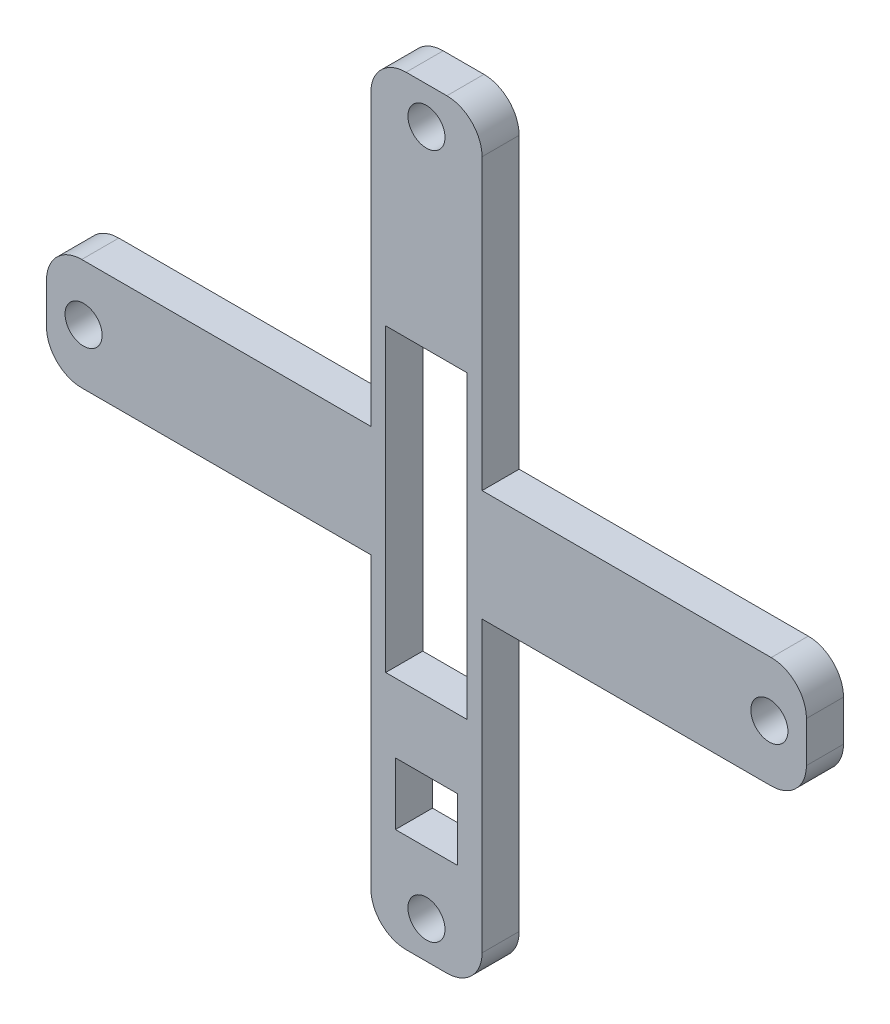
ISO-10303-21;
HEADER;
FILE_DESCRIPTION(('STEP AP214'),'2;1');
FILE_NAME('part.step','',(''),(''),'','','');
FILE_SCHEMA(('AUTOMOTIVE_DESIGN { 1 0 10303 214 1 1 1 1 }'));
ENDSEC;
DATA;
#1=APPLICATION_CONTEXT('core data for automotive mechanical design processes');
#2=APPLICATION_PROTOCOL_DEFINITION('international standard','automotive_design',2000,#1);
#3=PRODUCT_CONTEXT('',#1,'mechanical');
#4=PRODUCT('Part','Part','',(#3));
#5=PRODUCT_RELATED_PRODUCT_CATEGORY('part','',(#4));
#6=PRODUCT_DEFINITION_FORMATION('','',#4);
#7=PRODUCT_DEFINITION_CONTEXT('part definition',#1,'design');
#8=PRODUCT_DEFINITION('design','',#6,#7);
#9=PRODUCT_DEFINITION_SHAPE('','',#8);
#10=(LENGTH_UNIT() NAMED_UNIT(*) SI_UNIT(.MILLI.,.METRE.));
#11=(NAMED_UNIT(*) PLANE_ANGLE_UNIT() SI_UNIT($,.RADIAN.));
#12=(NAMED_UNIT(*) SI_UNIT($,.STERADIAN.) SOLID_ANGLE_UNIT());
#13=UNCERTAINTY_MEASURE_WITH_UNIT(LENGTH_MEASURE(1.E-05),#10,'distance_accuracy_value','');
#14=(GEOMETRIC_REPRESENTATION_CONTEXT(3) GLOBAL_UNCERTAINTY_ASSIGNED_CONTEXT((#13)) GLOBAL_UNIT_ASSIGNED_CONTEXT((#10,
#11,#12)) REPRESENTATION_CONTEXT('',''));
#15=CARTESIAN_POINT('',(0.,0.,0.));
#16=DIRECTION('',(0.,0.,1.));
#17=DIRECTION('',(1.,0.,0.));
#18=AXIS2_PLACEMENT_3D('',#15,#16,#17);
#19=CARTESIAN_POINT('',(-1.1,18.6,2.));
#20=DIRECTION('',(0.,0.,-1.));
#21=DIRECTION('',(-1.,0.,0.));
#22=AXIS2_PLACEMENT_3D('',#19,#20,#21);
#23=PLANE('',#22);
#24=CARTESIAN_POINT('',(-18.5,0.,2.));
#25=DIRECTION('',(0.,0.,1.));
#26=DIRECTION('',(1.,0.,0.));
#27=AXIS2_PLACEMENT_3D('',#24,#25,#26);
#28=CIRCLE('',#27,1.);
#29=CARTESIAN_POINT('',(-17.5,0.,2.));
#30=VERTEX_POINT('',#29);
#31=EDGE_CURVE('E254',#30,#30,#28,.T.);
#32=ORIENTED_EDGE('',*,*,#31,.F.);
#33=EDGE_LOOP('',(#32));
#34=FACE_BOUND('',#33,.T.);
#35=CARTESIAN_POINT('',(0.,-18.5,2.));
#36=DIRECTION('',(0.,0.,1.));
#37=DIRECTION('',(1.,0.,0.));
#38=AXIS2_PLACEMENT_3D('',#35,#36,#37);
#39=CIRCLE('',#38,1.);
#40=CARTESIAN_POINT('',(1.,-18.5,2.));
#41=VERTEX_POINT('',#40);
#42=EDGE_CURVE('E260',#41,#41,#39,.T.);
#43=ORIENTED_EDGE('',*,*,#42,.F.);
#44=EDGE_LOOP('',(#43));
#45=FACE_BOUND('',#44,.T.);
#46=CARTESIAN_POINT('',(18.5,0.,2.));
#47=DIRECTION('',(0.,0.,1.));
#48=DIRECTION('',(1.,0.,0.));
#49=AXIS2_PLACEMENT_3D('',#46,#47,#48);
#50=CIRCLE('',#49,1.);
#51=CARTESIAN_POINT('',(19.5,0.,2.));
#52=VERTEX_POINT('',#51);
#53=EDGE_CURVE('E266',#52,#52,#50,.T.);
#54=ORIENTED_EDGE('',*,*,#53,.F.);
#55=EDGE_LOOP('',(#54));
#56=FACE_BOUND('',#55,.T.);
#57=DIRECTION('',(0.,1.,0.));
#58=VECTOR('',#57,1.);
#59=CARTESIAN_POINT('',(1.675,-11.825,2.));
#60=LINE('',#59,#58);
#61=CARTESIAN_POINT('',(1.675,-15.175,2.));
#62=VERTEX_POINT('',#61);
#63=CARTESIAN_POINT('',(1.675,-11.825,2.));
#64=VERTEX_POINT('',#63);
#65=EDGE_CURVE('E272',#62,#64,#60,.T.);
#66=ORIENTED_EDGE('',*,*,#65,.F.);
#67=DIRECTION('',(1.,0.,0.));
#68=VECTOR('',#67,1.);
#69=CARTESIAN_POINT('',(-1.675,-15.175,2.));
#70=LINE('',#69,#68);
#71=CARTESIAN_POINT('',(-1.675,-15.175,2.));
#72=VERTEX_POINT('',#71);
#73=EDGE_CURVE('E280',#72,#62,#70,.T.);
#74=ORIENTED_EDGE('',*,*,#73,.F.);
#75=DIRECTION('',(0.,-1.,0.));
#76=VECTOR('',#75,1.);
#77=CARTESIAN_POINT('',(-1.675,-11.825,2.));
#78=LINE('',#77,#76);
#79=CARTESIAN_POINT('',(-1.675,-11.825,2.));
#80=VERTEX_POINT('',#79);
#81=EDGE_CURVE('E277',#80,#72,#78,.T.);
#82=ORIENTED_EDGE('',*,*,#81,.F.);
#83=DIRECTION('',(-1.,0.,0.));
#84=VECTOR('',#83,1.);
#85=CARTESIAN_POINT('',(-1.675,-11.825,2.));
#86=LINE('',#85,#84);
#87=EDGE_CURVE('E274',#64,#80,#86,.T.);
#88=ORIENTED_EDGE('',*,*,#87,.F.);
#89=EDGE_LOOP('',(#66,#74,#82,#88));
#90=FACE_BOUND('',#89,.T.);
#91=DIRECTION('',(-1.,0.,0.));
#92=VECTOR('',#91,1.);
#93=CARTESIAN_POINT('',(-18.6,3.,2.));
#94=LINE('',#93,#92);
#95=CARTESIAN_POINT('',(-3.,3.,2.));
#96=VERTEX_POINT('',#95);
#97=CARTESIAN_POINT('',(-18.6,3.,2.));
#98=VERTEX_POINT('',#97);
#99=EDGE_CURVE('E309',#96,#98,#94,.T.);
#100=ORIENTED_EDGE('',*,*,#99,.T.);
#101=CARTESIAN_POINT('',(-18.6,1.1,2.));
#102=DIRECTION('',(0.,0.,1.));
#103=DIRECTION('',(-1.,0.,0.));
#104=AXIS2_PLACEMENT_3D('',#101,#102,#103);
#105=CIRCLE('',#104,1.9);
#106=CARTESIAN_POINT('',(-20.5,1.1,2.));
#107=VERTEX_POINT('',#106);
#108=EDGE_CURVE('E312',#98,#107,#105,.T.);
#109=ORIENTED_EDGE('',*,*,#108,.T.);
#110=DIRECTION('',(0.,-1.,0.));
#111=VECTOR('',#110,1.);
#112=CARTESIAN_POINT('',(-20.5,-1.1,2.));
#113=LINE('',#112,#111);
#114=CARTESIAN_POINT('',(-20.5,-1.1,2.));
#115=VERTEX_POINT('',#114);
#116=EDGE_CURVE('E315',#107,#115,#113,.T.);
#117=ORIENTED_EDGE('',*,*,#116,.T.);
#118=CARTESIAN_POINT('',(-18.6,-1.1,2.));
#119=DIRECTION('',(0.,0.,1.));
#120=DIRECTION('',(-1.,0.,0.));
#121=AXIS2_PLACEMENT_3D('',#118,#119,#120);
#122=CIRCLE('',#121,1.9);
#123=CARTESIAN_POINT('',(-18.6,-3.,2.));
#124=VERTEX_POINT('',#123);
#125=EDGE_CURVE('E317',#115,#124,#122,.T.);
#126=ORIENTED_EDGE('',*,*,#125,.T.);
#127=DIRECTION('',(1.,0.,0.));
#128=VECTOR('',#127,1.);
#129=CARTESIAN_POINT('',(-3.,-3.,2.));
#130=LINE('',#129,#128);
#131=CARTESIAN_POINT('',(-3.,-3.,2.));
#132=VERTEX_POINT('',#131);
#133=EDGE_CURVE('E319',#124,#132,#130,.T.);
#134=ORIENTED_EDGE('',*,*,#133,.T.);
#135=DIRECTION('',(0.,-1.,0.));
#136=VECTOR('',#135,1.);
#137=CARTESIAN_POINT('',(-3.,-18.6,2.));
#138=LINE('',#137,#136);
#139=CARTESIAN_POINT('',(-3.,-18.6,2.));
#140=VERTEX_POINT('',#139);
#141=EDGE_CURVE('E321',#132,#140,#138,.T.);
#142=ORIENTED_EDGE('',*,*,#141,.T.);
#143=CARTESIAN_POINT('',(-1.1,-18.6,2.));
#144=DIRECTION('',(0.,0.,1.));
#145=DIRECTION('',(-1.,0.,0.));
#146=AXIS2_PLACEMENT_3D('',#143,#144,#145);
#147=CIRCLE('',#146,1.9);
#148=CARTESIAN_POINT('',(-1.1,-20.5,2.));
#149=VERTEX_POINT('',#148);
#150=EDGE_CURVE('E323',#140,#149,#147,.T.);
#151=ORIENTED_EDGE('',*,*,#150,.T.);
#152=DIRECTION('',(1.,0.,0.));
#153=VECTOR('',#152,1.);
#154=CARTESIAN_POINT('',(1.1,-20.5,2.));
#155=LINE('',#154,#153);
#156=CARTESIAN_POINT('',(1.1,-20.5,2.));
#157=VERTEX_POINT('',#156);
#158=EDGE_CURVE('E325',#149,#157,#155,.T.);
#159=ORIENTED_EDGE('',*,*,#158,.T.);
#160=CARTESIAN_POINT('',(1.1,-18.6,2.));
#161=DIRECTION('',(0.,0.,1.));
#162=DIRECTION('',(-1.,0.,0.));
#163=AXIS2_PLACEMENT_3D('',#160,#161,#162);
#164=CIRCLE('',#163,1.9);
#165=CARTESIAN_POINT('',(3.,-18.6,2.));
#166=VERTEX_POINT('',#165);
#167=EDGE_CURVE('E327',#157,#166,#164,.T.);
#168=ORIENTED_EDGE('',*,*,#167,.T.);
#169=DIRECTION('',(0.,1.,0.));
#170=VECTOR('',#169,1.);
#171=CARTESIAN_POINT('',(3.,-3.,2.));
#172=LINE('',#171,#170);
#173=CARTESIAN_POINT('',(3.,-3.,2.));
#174=VERTEX_POINT('',#173);
#175=EDGE_CURVE('E329',#166,#174,#172,.T.);
#176=ORIENTED_EDGE('',*,*,#175,.T.);
#177=DIRECTION('',(1.,0.,0.));
#178=VECTOR('',#177,1.);
#179=CARTESIAN_POINT('',(18.6,-3.,2.));
#180=LINE('',#179,#178);
#181=CARTESIAN_POINT('',(18.6,-3.,2.));
#182=VERTEX_POINT('',#181);
#183=EDGE_CURVE('E331',#174,#182,#180,.T.);
#184=ORIENTED_EDGE('',*,*,#183,.T.);
#185=CARTESIAN_POINT('',(18.6,-1.1,2.));
#186=DIRECTION('',(0.,0.,1.));
#187=DIRECTION('',(-1.,0.,0.));
#188=AXIS2_PLACEMENT_3D('',#185,#186,#187);
#189=CIRCLE('',#188,1.9);
#190=CARTESIAN_POINT('',(20.5,-1.1,2.));
#191=VERTEX_POINT('',#190);
#192=EDGE_CURVE('E333',#182,#191,#189,.T.);
#193=ORIENTED_EDGE('',*,*,#192,.T.);
#194=DIRECTION('',(0.,1.,0.));
#195=VECTOR('',#194,1.);
#196=CARTESIAN_POINT('',(20.5,1.1,2.));
#197=LINE('',#196,#195);
#198=CARTESIAN_POINT('',(20.5,1.1,2.));
#199=VERTEX_POINT('',#198);
#200=EDGE_CURVE('E335',#191,#199,#197,.T.);
#201=ORIENTED_EDGE('',*,*,#200,.T.);
#202=CARTESIAN_POINT('',(18.6,1.1,2.));
#203=DIRECTION('',(0.,0.,1.));
#204=DIRECTION('',(-1.,0.,0.));
#205=AXIS2_PLACEMENT_3D('',#202,#203,#204);
#206=CIRCLE('',#205,1.9);
#207=CARTESIAN_POINT('',(18.6,3.,2.));
#208=VERTEX_POINT('',#207);
#209=EDGE_CURVE('E337',#199,#208,#206,.T.);
#210=ORIENTED_EDGE('',*,*,#209,.T.);
#211=DIRECTION('',(-1.,0.,0.));
#212=VECTOR('',#211,1.);
#213=CARTESIAN_POINT('',(3.,3.,2.));
#214=LINE('',#213,#212);
#215=CARTESIAN_POINT('',(3.,3.,2.));
#216=VERTEX_POINT('',#215);
#217=EDGE_CURVE('E339',#208,#216,#214,.T.);
#218=ORIENTED_EDGE('',*,*,#217,.T.);
#219=DIRECTION('',(0.,1.,0.));
#220=VECTOR('',#219,1.);
#221=CARTESIAN_POINT('',(2.99999999999999,18.6,2.));
#222=LINE('',#221,#220);
#223=CARTESIAN_POINT('',(2.99999999999999,18.6,2.));
#224=VERTEX_POINT('',#223);
#225=EDGE_CURVE('E341',#216,#224,#222,.T.);
#226=ORIENTED_EDGE('',*,*,#225,.T.);
#227=CARTESIAN_POINT('',(1.09999999999999,18.6,2.));
#228=DIRECTION('',(0.,0.,1.));
#229=DIRECTION('',(-1.,0.,0.));
#230=AXIS2_PLACEMENT_3D('',#227,#228,#229);
#231=CIRCLE('',#230,1.9);
#232=CARTESIAN_POINT('',(1.09999999999999,20.5,2.));
#233=VERTEX_POINT('',#232);
#234=EDGE_CURVE('E343',#224,#233,#231,.T.);
#235=ORIENTED_EDGE('',*,*,#234,.T.);
#236=DIRECTION('',(-1.,0.,0.));
#237=VECTOR('',#236,1.);
#238=CARTESIAN_POINT('',(-1.1,20.5,2.));
#239=LINE('',#238,#237);
#240=CARTESIAN_POINT('',(-1.1,20.5,2.));
#241=VERTEX_POINT('',#240);
#242=EDGE_CURVE('E345',#233,#241,#239,.T.);
#243=ORIENTED_EDGE('',*,*,#242,.T.);
#244=CARTESIAN_POINT('',(-1.1,18.6,2.));
#245=DIRECTION('',(0.,0.,1.));
#246=DIRECTION('',(-1.,0.,0.));
#247=AXIS2_PLACEMENT_3D('',#244,#245,#246);
#248=CIRCLE('',#247,1.9);
#249=CARTESIAN_POINT('',(-3.,18.6,2.));
#250=VERTEX_POINT('',#249);
#251=EDGE_CURVE('E347',#241,#250,#248,.T.);
#252=ORIENTED_EDGE('',*,*,#251,.T.);
#253=DIRECTION('',(0.,-1.,0.));
#254=VECTOR('',#253,1.);
#255=CARTESIAN_POINT('',(-3.,3.,2.));
#256=LINE('',#255,#254);
#257=EDGE_CURVE('E349',#250,#96,#256,.T.);
#258=ORIENTED_EDGE('',*,*,#257,.T.);
#259=EDGE_LOOP('',(#100,#109,#117,#126,#134,#142,#151,#159,#168,#176,#184,#193,#201,#210,#218,
#226,#235,#243,#252,#258));
#260=FACE_BOUND('',#259,.T.);
#261=CARTESIAN_POINT('',(0.,18.5,2.));
#262=DIRECTION('',(0.,0.,1.));
#263=DIRECTION('',(1.,0.,0.));
#264=AXIS2_PLACEMENT_3D('',#261,#262,#263);
#265=CIRCLE('',#264,1.);
#266=CARTESIAN_POINT('',(0.999999999999995,18.5,2.));
#267=VERTEX_POINT('',#266);
#268=EDGE_CURVE('E303',#267,#267,#265,.T.);
#269=ORIENTED_EDGE('',*,*,#268,.F.);
#270=EDGE_LOOP('',(#269));
#271=FACE_BOUND('',#270,.T.);
#272=DIRECTION('',(0.,1.,0.));
#273=VECTOR('',#272,1.);
#274=CARTESIAN_POINT('',(2.2,-8.1,2.));
#275=LINE('',#274,#273);
#276=CARTESIAN_POINT('',(2.2,-8.1,2.));
#277=VERTEX_POINT('',#276);
#278=CARTESIAN_POINT('',(2.2,8.1,2.));
#279=VERTEX_POINT('',#278);
#280=EDGE_CURVE('E218',#277,#279,#275,.T.);
#281=ORIENTED_EDGE('',*,*,#280,.F.);
#282=DIRECTION('',(1.,0.,0.));
#283=VECTOR('',#282,1.);
#284=CARTESIAN_POINT('',(-2.2,-8.1,2.));
#285=LINE('',#284,#283);
#286=CARTESIAN_POINT('',(-2.2,-8.1,2.));
#287=VERTEX_POINT('',#286);
#288=EDGE_CURVE('E240',#287,#277,#285,.T.);
#289=ORIENTED_EDGE('',*,*,#288,.F.);
#290=DIRECTION('',(0.,-1.,0.));
#291=VECTOR('',#290,1.);
#292=CARTESIAN_POINT('',(-2.2,-8.1,2.));
#293=LINE('',#292,#291);
#294=CARTESIAN_POINT('',(-2.2,8.1,2.));
#295=VERTEX_POINT('',#294);
#296=EDGE_CURVE('E238',#295,#287,#293,.T.);
#297=ORIENTED_EDGE('',*,*,#296,.F.);
#298=DIRECTION('',(-1.,0.,0.));
#299=VECTOR('',#298,1.);
#300=CARTESIAN_POINT('',(-2.2,8.1,2.));
#301=LINE('',#300,#299);
#302=EDGE_CURVE('E226',#279,#295,#301,.T.);
#303=ORIENTED_EDGE('',*,*,#302,.F.);
#304=EDGE_LOOP('',(#281,#289,#297,#303));
#305=FACE_BOUND('',#304,.T.);
#306=ADVANCED_FACE('F33',(#34,#45,#56,#90,#260,#271,#305),#23,.F.);
#307=CARTESIAN_POINT('',(-1.1,18.6,0.));
#308=DIRECTION('',(0.,0.,-1.));
#309=DIRECTION('',(-1.,0.,0.));
#310=AXIS2_PLACEMENT_3D('',#307,#308,#309);
#311=PLANE('',#310);
#312=CARTESIAN_POINT('',(0.,-18.5,0.));
#313=DIRECTION('',(0.,0.,1.));
#314=DIRECTION('',(1.,0.,0.));
#315=AXIS2_PLACEMENT_3D('',#312,#313,#314);
#316=CIRCLE('',#315,1.);
#317=CARTESIAN_POINT('',(1.,-18.5,0.));
#318=VERTEX_POINT('',#317);
#319=EDGE_CURVE('E257',#318,#318,#316,.T.);
#320=ORIENTED_EDGE('',*,*,#319,.T.);
#321=EDGE_LOOP('',(#320));
#322=FACE_BOUND('',#321,.T.);
#323=DIRECTION('',(1.,0.,0.));
#324=VECTOR('',#323,1.);
#325=CARTESIAN_POINT('',(-1.675,-15.175,0.));
#326=LINE('',#325,#324);
#327=CARTESIAN_POINT('',(-1.675,-15.175,0.));
#328=VERTEX_POINT('',#327);
#329=CARTESIAN_POINT('',(1.675,-15.175,0.));
#330=VERTEX_POINT('',#329);
#331=EDGE_CURVE('E275',#328,#330,#326,.T.);
#332=ORIENTED_EDGE('',*,*,#331,.T.);
#333=DIRECTION('',(0.,1.,0.));
#334=VECTOR('',#333,1.);
#335=CARTESIAN_POINT('',(1.675,-11.825,0.));
#336=LINE('',#335,#334);
#337=CARTESIAN_POINT('',(1.675,-11.825,0.));
#338=VERTEX_POINT('',#337);
#339=EDGE_CURVE('E269',#330,#338,#336,.T.);
#340=ORIENTED_EDGE('',*,*,#339,.T.);
#341=DIRECTION('',(-1.,0.,0.));
#342=VECTOR('',#341,1.);
#343=CARTESIAN_POINT('',(-1.675,-11.825,0.));
#344=LINE('',#343,#342);
#345=CARTESIAN_POINT('',(-1.675,-11.825,0.));
#346=VERTEX_POINT('',#345);
#347=EDGE_CURVE('E285',#338,#346,#344,.T.);
#348=ORIENTED_EDGE('',*,*,#347,.T.);
#349=DIRECTION('',(0.,-1.,0.));
#350=VECTOR('',#349,1.);
#351=CARTESIAN_POINT('',(-1.675,-11.825,0.));
#352=LINE('',#351,#350);
#353=EDGE_CURVE('E288',#346,#328,#352,.T.);
#354=ORIENTED_EDGE('',*,*,#353,.T.);
#355=EDGE_LOOP('',(#332,#340,#348,#354));
#356=FACE_BOUND('',#355,.T.);
#357=CARTESIAN_POINT('',(0.,18.5,0.));
#358=DIRECTION('',(0.,0.,1.));
#359=DIRECTION('',(1.,0.,0.));
#360=AXIS2_PLACEMENT_3D('',#357,#358,#359);
#361=CIRCLE('',#360,1.);
#362=CARTESIAN_POINT('',(0.999999999999995,18.5,0.));
#363=VERTEX_POINT('',#362);
#364=EDGE_CURVE('E302',#363,#363,#361,.T.);
#365=ORIENTED_EDGE('',*,*,#364,.T.);
#366=EDGE_LOOP('',(#365));
#367=FACE_BOUND('',#366,.T.);
#368=DIRECTION('',(-1.,0.,0.));
#369=VECTOR('',#368,1.);
#370=CARTESIAN_POINT('',(-18.6,3.,0.));
#371=LINE('',#370,#369);
#372=CARTESIAN_POINT('',(-3.,3.,0.));
#373=VERTEX_POINT('',#372);
#374=CARTESIAN_POINT('',(-18.6,3.,0.));
#375=VERTEX_POINT('',#374);
#376=EDGE_CURVE('E306',#373,#375,#371,.T.);
#377=ORIENTED_EDGE('',*,*,#376,.F.);
#378=DIRECTION('',(0.,-1.,0.));
#379=VECTOR('',#378,1.);
#380=CARTESIAN_POINT('',(-3.,3.,0.));
#381=LINE('',#380,#379);
#382=CARTESIAN_POINT('',(-3.,18.6,0.));
#383=VERTEX_POINT('',#382);
#384=EDGE_CURVE('E313',#383,#373,#381,.T.);
#385=ORIENTED_EDGE('',*,*,#384,.F.);
#386=CARTESIAN_POINT('',(-1.1,18.6,0.));
#387=DIRECTION('',(0.,0.,1.));
#388=DIRECTION('',(-1.,0.,0.));
#389=AXIS2_PLACEMENT_3D('',#386,#387,#388);
#390=CIRCLE('',#389,1.9);
#391=CARTESIAN_POINT('',(-1.1,20.5,0.));
#392=VERTEX_POINT('',#391);
#393=EDGE_CURVE('E388',#392,#383,#390,.T.);
#394=ORIENTED_EDGE('',*,*,#393,.F.);
#395=DIRECTION('',(-1.,0.,0.));
#396=VECTOR('',#395,1.);
#397=CARTESIAN_POINT('',(-1.1,20.5,0.));
#398=LINE('',#397,#396);
#399=CARTESIAN_POINT('',(1.09999999999999,20.5,0.));
#400=VERTEX_POINT('',#399);
#401=EDGE_CURVE('E386',#400,#392,#398,.T.);
#402=ORIENTED_EDGE('',*,*,#401,.F.);
#403=CARTESIAN_POINT('',(1.09999999999999,18.6,0.));
#404=DIRECTION('',(0.,0.,1.));
#405=DIRECTION('',(-1.,0.,0.));
#406=AXIS2_PLACEMENT_3D('',#403,#404,#405);
#407=CIRCLE('',#406,1.9);
#408=CARTESIAN_POINT('',(2.99999999999999,18.6,0.));
#409=VERTEX_POINT('',#408);
#410=EDGE_CURVE('E384',#409,#400,#407,.T.);
#411=ORIENTED_EDGE('',*,*,#410,.F.);
#412=DIRECTION('',(0.,1.,0.));
#413=VECTOR('',#412,1.);
#414=CARTESIAN_POINT('',(2.99999999999999,18.6,0.));
#415=LINE('',#414,#413);
#416=CARTESIAN_POINT('',(3.,3.,0.));
#417=VERTEX_POINT('',#416);
#418=EDGE_CURVE('E382',#417,#409,#415,.T.);
#419=ORIENTED_EDGE('',*,*,#418,.F.);
#420=DIRECTION('',(-1.,0.,0.));
#421=VECTOR('',#420,1.);
#422=CARTESIAN_POINT('',(3.,3.,0.));
#423=LINE('',#422,#421);
#424=CARTESIAN_POINT('',(18.6,3.,0.));
#425=VERTEX_POINT('',#424);
#426=EDGE_CURVE('E380',#425,#417,#423,.T.);
#427=ORIENTED_EDGE('',*,*,#426,.F.);
#428=CARTESIAN_POINT('',(18.6,1.1,0.));
#429=DIRECTION('',(0.,0.,1.));
#430=DIRECTION('',(-1.,0.,0.));
#431=AXIS2_PLACEMENT_3D('',#428,#429,#430);
#432=CIRCLE('',#431,1.9);
#433=CARTESIAN_POINT('',(20.5,1.1,0.));
#434=VERTEX_POINT('',#433);
#435=EDGE_CURVE('E378',#434,#425,#432,.T.);
#436=ORIENTED_EDGE('',*,*,#435,.F.);
#437=DIRECTION('',(0.,1.,0.));
#438=VECTOR('',#437,1.);
#439=CARTESIAN_POINT('',(20.5,1.1,0.));
#440=LINE('',#439,#438);
#441=CARTESIAN_POINT('',(20.5,-1.1,0.));
#442=VERTEX_POINT('',#441);
#443=EDGE_CURVE('E376',#442,#434,#440,.T.);
#444=ORIENTED_EDGE('',*,*,#443,.F.);
#445=CARTESIAN_POINT('',(18.6,-1.1,0.));
#446=DIRECTION('',(0.,0.,1.));
#447=DIRECTION('',(-1.,0.,0.));
#448=AXIS2_PLACEMENT_3D('',#445,#446,#447);
#449=CIRCLE('',#448,1.9);
#450=CARTESIAN_POINT('',(18.6,-3.,0.));
#451=VERTEX_POINT('',#450);
#452=EDGE_CURVE('E374',#451,#442,#449,.T.);
#453=ORIENTED_EDGE('',*,*,#452,.F.);
#454=DIRECTION('',(1.,0.,0.));
#455=VECTOR('',#454,1.);
#456=CARTESIAN_POINT('',(18.6,-3.,0.));
#457=LINE('',#456,#455);
#458=CARTESIAN_POINT('',(3.,-3.,0.));
#459=VERTEX_POINT('',#458);
#460=EDGE_CURVE('E372',#459,#451,#457,.T.);
#461=ORIENTED_EDGE('',*,*,#460,.F.);
#462=DIRECTION('',(0.,1.,0.));
#463=VECTOR('',#462,1.);
#464=CARTESIAN_POINT('',(3.,-3.,0.));
#465=LINE('',#464,#463);
#466=CARTESIAN_POINT('',(3.,-18.6,0.));
#467=VERTEX_POINT('',#466);
#468=EDGE_CURVE('E370',#467,#459,#465,.T.);
#469=ORIENTED_EDGE('',*,*,#468,.F.);
#470=CARTESIAN_POINT('',(1.1,-18.6,0.));
#471=DIRECTION('',(0.,0.,1.));
#472=DIRECTION('',(-1.,0.,0.));
#473=AXIS2_PLACEMENT_3D('',#470,#471,#472);
#474=CIRCLE('',#473,1.9);
#475=CARTESIAN_POINT('',(1.1,-20.5,0.));
#476=VERTEX_POINT('',#475);
#477=EDGE_CURVE('E368',#476,#467,#474,.T.);
#478=ORIENTED_EDGE('',*,*,#477,.F.);
#479=DIRECTION('',(1.,0.,0.));
#480=VECTOR('',#479,1.);
#481=CARTESIAN_POINT('',(1.1,-20.5,0.));
#482=LINE('',#481,#480);
#483=CARTESIAN_POINT('',(-1.1,-20.5,0.));
#484=VERTEX_POINT('',#483);
#485=EDGE_CURVE('E366',#484,#476,#482,.T.);
#486=ORIENTED_EDGE('',*,*,#485,.F.);
#487=CARTESIAN_POINT('',(-1.1,-18.6,0.));
#488=DIRECTION('',(0.,0.,1.));
#489=DIRECTION('',(-1.,0.,0.));
#490=AXIS2_PLACEMENT_3D('',#487,#488,#489);
#491=CIRCLE('',#490,1.9);
#492=CARTESIAN_POINT('',(-3.,-18.6,0.));
#493=VERTEX_POINT('',#492);
#494=EDGE_CURVE('E364',#493,#484,#491,.T.);
#495=ORIENTED_EDGE('',*,*,#494,.F.);
#496=DIRECTION('',(0.,-1.,0.));
#497=VECTOR('',#496,1.);
#498=CARTESIAN_POINT('',(-3.,-18.6,0.));
#499=LINE('',#498,#497);
#500=CARTESIAN_POINT('',(-3.,-3.,0.));
#501=VERTEX_POINT('',#500);
#502=EDGE_CURVE('E362',#501,#493,#499,.T.);
#503=ORIENTED_EDGE('',*,*,#502,.F.);
#504=DIRECTION('',(1.,0.,0.));
#505=VECTOR('',#504,1.);
#506=CARTESIAN_POINT('',(-3.,-3.,0.));
#507=LINE('',#506,#505);
#508=CARTESIAN_POINT('',(-18.6,-3.,0.));
#509=VERTEX_POINT('',#508);
#510=EDGE_CURVE('E360',#509,#501,#507,.T.);
#511=ORIENTED_EDGE('',*,*,#510,.F.);
#512=CARTESIAN_POINT('',(-18.6,-1.1,0.));
#513=DIRECTION('',(0.,0.,1.));
#514=DIRECTION('',(-1.,0.,0.));
#515=AXIS2_PLACEMENT_3D('',#512,#513,#514);
#516=CIRCLE('',#515,1.9);
#517=CARTESIAN_POINT('',(-20.5,-1.1,0.));
#518=VERTEX_POINT('',#517);
#519=EDGE_CURVE('E358',#518,#509,#516,.T.);
#520=ORIENTED_EDGE('',*,*,#519,.F.);
#521=DIRECTION('',(0.,-1.,0.));
#522=VECTOR('',#521,1.);
#523=CARTESIAN_POINT('',(-20.5,-1.1,0.));
#524=LINE('',#523,#522);
#525=CARTESIAN_POINT('',(-20.5,1.1,0.));
#526=VERTEX_POINT('',#525);
#527=EDGE_CURVE('E356',#526,#518,#524,.T.);
#528=ORIENTED_EDGE('',*,*,#527,.F.);
#529=CARTESIAN_POINT('',(-18.6,1.1,0.));
#530=DIRECTION('',(0.,0.,1.));
#531=DIRECTION('',(-1.,0.,0.));
#532=AXIS2_PLACEMENT_3D('',#529,#530,#531);
#533=CIRCLE('',#532,1.9);
#534=EDGE_CURVE('E354',#375,#526,#533,.T.);
#535=ORIENTED_EDGE('',*,*,#534,.F.);
#536=EDGE_LOOP('',(#377,#385,#394,#402,#411,#419,#427,#436,#444,#453,#461,#469,#478,#486,#495,
#503,#511,#520,#528,#535));
#537=FACE_BOUND('',#536,.T.);
#538=CARTESIAN_POINT('',(18.5,0.,0.));
#539=DIRECTION('',(0.,0.,1.));
#540=DIRECTION('',(1.,0.,0.));
#541=AXIS2_PLACEMENT_3D('',#538,#539,#540);
#542=CIRCLE('',#541,1.);
#543=CARTESIAN_POINT('',(19.5,0.,0.));
#544=VERTEX_POINT('',#543);
#545=EDGE_CURVE('E263',#544,#544,#542,.T.);
#546=ORIENTED_EDGE('',*,*,#545,.T.);
#547=EDGE_LOOP('',(#546));
#548=FACE_BOUND('',#547,.T.);
#549=CARTESIAN_POINT('',(-18.5,0.,0.));
#550=DIRECTION('',(0.,0.,1.));
#551=DIRECTION('',(1.,0.,0.));
#552=AXIS2_PLACEMENT_3D('',#549,#550,#551);
#553=CIRCLE('',#552,1.);
#554=CARTESIAN_POINT('',(-17.5,0.,0.));
#555=VERTEX_POINT('',#554);
#556=EDGE_CURVE('E234',#555,#555,#553,.T.);
#557=ORIENTED_EDGE('',*,*,#556,.T.);
#558=EDGE_LOOP('',(#557));
#559=FACE_BOUND('',#558,.T.);
#560=DIRECTION('',(1.,0.,0.));
#561=VECTOR('',#560,1.);
#562=CARTESIAN_POINT('',(-2.2,-8.1,0.));
#563=LINE('',#562,#561);
#564=CARTESIAN_POINT('',(-2.2,-8.1,0.));
#565=VERTEX_POINT('',#564);
#566=CARTESIAN_POINT('',(2.2,-8.1,0.));
#567=VERTEX_POINT('',#566);
#568=EDGE_CURVE('E227',#565,#567,#563,.T.);
#569=ORIENTED_EDGE('',*,*,#568,.T.);
#570=DIRECTION('',(0.,1.,0.));
#571=VECTOR('',#570,1.);
#572=CARTESIAN_POINT('',(2.2,-8.1,0.));
#573=LINE('',#572,#571);
#574=CARTESIAN_POINT('',(2.2,8.1,0.));
#575=VERTEX_POINT('',#574);
#576=EDGE_CURVE('E56',#567,#575,#573,.T.);
#577=ORIENTED_EDGE('',*,*,#576,.T.);
#578=DIRECTION('',(-1.,0.,0.));
#579=VECTOR('',#578,1.);
#580=CARTESIAN_POINT('',(-2.2,8.1,0.));
#581=LINE('',#580,#579);
#582=CARTESIAN_POINT('',(-2.2,8.1,0.));
#583=VERTEX_POINT('',#582);
#584=EDGE_CURVE('E233',#575,#583,#581,.T.);
#585=ORIENTED_EDGE('',*,*,#584,.T.);
#586=DIRECTION('',(0.,-1.,0.));
#587=VECTOR('',#586,1.);
#588=CARTESIAN_POINT('',(-2.2,-8.1,0.));
#589=LINE('',#588,#587);
#590=EDGE_CURVE('E246',#583,#565,#589,.T.);
#591=ORIENTED_EDGE('',*,*,#590,.T.);
#592=EDGE_LOOP('',(#569,#577,#585,#591));
#593=FACE_BOUND('',#592,.T.);
#594=ADVANCED_FACE('F454',(#322,#356,#367,#537,#548,#559,#593),#311,.T.);
#595=CARTESIAN_POINT('',(-18.6,3.,2.));
#596=DIRECTION('',(0.,-1.,0.));
#597=DIRECTION('',(1.,0.,0.));
#598=AXIS2_PLACEMENT_3D('',#595,#596,#597);
#599=PLANE('',#598);
#600=ORIENTED_EDGE('',*,*,#376,.T.);
#601=DIRECTION('',(0.,0.,-1.));
#602=VECTOR('',#601,1.);
#603=CARTESIAN_POINT('',(-18.6,3.,2.));
#604=LINE('',#603,#602);
#605=EDGE_CURVE('E11',#98,#375,#604,.T.);
#606=ORIENTED_EDGE('',*,*,#605,.F.);
#607=ORIENTED_EDGE('',*,*,#99,.F.);
#608=DIRECTION('',(0.,0.,-1.));
#609=VECTOR('',#608,1.);
#610=CARTESIAN_POINT('',(-3.,3.,2.));
#611=LINE('',#610,#609);
#612=EDGE_CURVE('E351',#96,#373,#611,.T.);
#613=ORIENTED_EDGE('',*,*,#612,.T.);
#614=EDGE_LOOP('',(#600,#606,#607,#613));
#615=FACE_BOUND('',#614,.T.);
#616=ADVANCED_FACE('F35',(#615),#599,.F.);
#617=CARTESIAN_POINT('',(-18.6,1.1,2.));
#618=DIRECTION('',(0.,0.,-1.));
#619=DIRECTION('',(-1.,0.,0.));
#620=AXIS2_PLACEMENT_3D('',#617,#618,#619);
#621=CYLINDRICAL_SURFACE('',#620,1.9);
#622=ORIENTED_EDGE('',*,*,#534,.T.);
#623=DIRECTION('',(0.,0.,-1.));
#624=VECTOR('',#623,1.);
#625=CARTESIAN_POINT('',(-20.5,1.1,2.));
#626=LINE('',#625,#624);
#627=EDGE_CURVE('E41',#107,#526,#626,.T.);
#628=ORIENTED_EDGE('',*,*,#627,.F.);
#629=ORIENTED_EDGE('',*,*,#108,.F.);
#630=ORIENTED_EDGE('',*,*,#605,.T.);
#631=EDGE_LOOP('',(#622,#628,#629,#630));
#632=FACE_BOUND('',#631,.T.);
#633=ADVANCED_FACE('F472',(#632),#621,.T.);
#634=CARTESIAN_POINT('',(-20.5,-1.1,2.));
#635=DIRECTION('',(1.,0.,0.));
#636=DIRECTION('',(0.,1.,0.));
#637=AXIS2_PLACEMENT_3D('',#634,#635,#636);
#638=PLANE('',#637);
#639=ORIENTED_EDGE('',*,*,#527,.T.);
#640=DIRECTION('',(0.,0.,-1.));
#641=VECTOR('',#640,1.);
#642=CARTESIAN_POINT('',(-20.5,-1.1,2.));
#643=LINE('',#642,#641);
#644=EDGE_CURVE('E441',#115,#518,#643,.T.);
#645=ORIENTED_EDGE('',*,*,#644,.F.);
#646=ORIENTED_EDGE('',*,*,#116,.F.);
#647=ORIENTED_EDGE('',*,*,#627,.T.);
#648=EDGE_LOOP('',(#639,#645,#646,#647));
#649=FACE_BOUND('',#648,.T.);
#650=ADVANCED_FACE('F448',(#649),#638,.F.);
#651=CARTESIAN_POINT('',(-18.6,-1.1,2.));
#652=DIRECTION('',(0.,0.,-1.));
#653=DIRECTION('',(-1.,0.,0.));
#654=AXIS2_PLACEMENT_3D('',#651,#652,#653);
#655=CYLINDRICAL_SURFACE('',#654,1.9);
#656=ORIENTED_EDGE('',*,*,#519,.T.);
#657=DIRECTION('',(0.,0.,-1.));
#658=VECTOR('',#657,1.);
#659=CARTESIAN_POINT('',(-18.6,-3.,2.));
#660=LINE('',#659,#658);
#661=EDGE_CURVE('E438',#124,#509,#660,.T.);
#662=ORIENTED_EDGE('',*,*,#661,.F.);
#663=ORIENTED_EDGE('',*,*,#125,.F.);
#664=ORIENTED_EDGE('',*,*,#644,.T.);
#665=EDGE_LOOP('',(#656,#662,#663,#664));
#666=FACE_BOUND('',#665,.T.);
#667=ADVANCED_FACE('F460',(#666),#655,.T.);
#668=CARTESIAN_POINT('',(-3.,-3.,2.));
#669=DIRECTION('',(0.,1.,0.));
#670=DIRECTION('',(-1.,0.,0.));
#671=AXIS2_PLACEMENT_3D('',#668,#669,#670);
#672=PLANE('',#671);
#673=ORIENTED_EDGE('',*,*,#510,.T.);
#674=DIRECTION('',(0.,0.,-1.));
#675=VECTOR('',#674,1.);
#676=CARTESIAN_POINT('',(-3.,-3.,2.));
#677=LINE('',#676,#675);
#678=EDGE_CURVE('E435',#132,#501,#677,.T.);
#679=ORIENTED_EDGE('',*,*,#678,.F.);
#680=ORIENTED_EDGE('',*,*,#133,.F.);
#681=ORIENTED_EDGE('',*,*,#661,.T.);
#682=EDGE_LOOP('',(#673,#679,#680,#681));
#683=FACE_BOUND('',#682,.T.);
#684=ADVANCED_FACE('F464',(#683),#672,.F.);
#685=CARTESIAN_POINT('',(-3.,-18.6,2.));
#686=DIRECTION('',(1.,0.,0.));
#687=DIRECTION('',(0.,1.,0.));
#688=AXIS2_PLACEMENT_3D('',#685,#686,#687);
#689=PLANE('',#688);
#690=ORIENTED_EDGE('',*,*,#502,.T.);
#691=DIRECTION('',(0.,0.,-1.));
#692=VECTOR('',#691,1.);
#693=CARTESIAN_POINT('',(-3.,-18.6,2.));
#694=LINE('',#693,#692);
#695=EDGE_CURVE('E432',#140,#493,#694,.T.);
#696=ORIENTED_EDGE('',*,*,#695,.F.);
#697=ORIENTED_EDGE('',*,*,#141,.F.);
#698=ORIENTED_EDGE('',*,*,#678,.T.);
#699=EDGE_LOOP('',(#690,#696,#697,#698));
#700=FACE_BOUND('',#699,.T.);
#701=ADVANCED_FACE('F545',(#700),#689,.F.);
#702=CARTESIAN_POINT('',(-1.1,-18.6,2.));
#703=DIRECTION('',(0.,0.,-1.));
#704=DIRECTION('',(-1.,0.,0.));
#705=AXIS2_PLACEMENT_3D('',#702,#703,#704);
#706=CYLINDRICAL_SURFACE('',#705,1.9);
#707=ORIENTED_EDGE('',*,*,#494,.T.);
#708=DIRECTION('',(0.,0.,-1.));
#709=VECTOR('',#708,1.);
#710=CARTESIAN_POINT('',(-1.1,-20.5,2.));
#711=LINE('',#710,#709);
#712=EDGE_CURVE('E429',#149,#484,#711,.T.);
#713=ORIENTED_EDGE('',*,*,#712,.F.);
#714=ORIENTED_EDGE('',*,*,#150,.F.);
#715=ORIENTED_EDGE('',*,*,#695,.T.);
#716=EDGE_LOOP('',(#707,#713,#714,#715));
#717=FACE_BOUND('',#716,.T.);
#718=ADVANCED_FACE('F543',(#717),#706,.T.);
#719=CARTESIAN_POINT('',(1.1,-20.5,2.));
#720=DIRECTION('',(0.,1.,0.));
#721=DIRECTION('',(-1.,0.,0.));
#722=AXIS2_PLACEMENT_3D('',#719,#720,#721);
#723=PLANE('',#722);
#724=ORIENTED_EDGE('',*,*,#485,.T.);
#725=DIRECTION('',(0.,0.,-1.));
#726=VECTOR('',#725,1.);
#727=CARTESIAN_POINT('',(1.1,-20.5,2.));
#728=LINE('',#727,#726);
#729=EDGE_CURVE('E426',#157,#476,#728,.T.);
#730=ORIENTED_EDGE('',*,*,#729,.F.);
#731=ORIENTED_EDGE('',*,*,#158,.F.);
#732=ORIENTED_EDGE('',*,*,#712,.T.);
#733=EDGE_LOOP('',(#724,#730,#731,#732));
#734=FACE_BOUND('',#733,.T.);
#735=ADVANCED_FACE('F538',(#734),#723,.F.);
#736=CARTESIAN_POINT('',(1.1,-18.6,2.));
#737=DIRECTION('',(0.,0.,-1.));
#738=DIRECTION('',(-1.,0.,0.));
#739=AXIS2_PLACEMENT_3D('',#736,#737,#738);
#740=CYLINDRICAL_SURFACE('',#739,1.9);
#741=ORIENTED_EDGE('',*,*,#477,.T.);
#742=DIRECTION('',(0.,0.,-1.));
#743=VECTOR('',#742,1.);
#744=CARTESIAN_POINT('',(3.,-18.6,2.));
#745=LINE('',#744,#743);
#746=EDGE_CURVE('E423',#166,#467,#745,.T.);
#747=ORIENTED_EDGE('',*,*,#746,.F.);
#748=ORIENTED_EDGE('',*,*,#167,.F.);
#749=ORIENTED_EDGE('',*,*,#729,.T.);
#750=EDGE_LOOP('',(#741,#747,#748,#749));
#751=FACE_BOUND('',#750,.T.);
#752=ADVANCED_FACE('F533',(#751),#740,.T.);
#753=CARTESIAN_POINT('',(3.,-3.,2.));
#754=DIRECTION('',(-1.,0.,0.));
#755=DIRECTION('',(0.,-1.,0.));
#756=AXIS2_PLACEMENT_3D('',#753,#754,#755);
#757=PLANE('',#756);
#758=ORIENTED_EDGE('',*,*,#468,.T.);
#759=DIRECTION('',(0.,0.,-1.));
#760=VECTOR('',#759,1.);
#761=CARTESIAN_POINT('',(3.,-3.,2.));
#762=LINE('',#761,#760);
#763=EDGE_CURVE('E420',#174,#459,#762,.T.);
#764=ORIENTED_EDGE('',*,*,#763,.F.);
#765=ORIENTED_EDGE('',*,*,#175,.F.);
#766=ORIENTED_EDGE('',*,*,#746,.T.);
#767=EDGE_LOOP('',(#758,#764,#765,#766));
#768=FACE_BOUND('',#767,.T.);
#769=ADVANCED_FACE('F529',(#768),#757,.F.);
#770=CARTESIAN_POINT('',(18.6,-3.,2.));
#771=DIRECTION('',(0.,1.,0.));
#772=DIRECTION('',(-1.,0.,0.));
#773=AXIS2_PLACEMENT_3D('',#770,#771,#772);
#774=PLANE('',#773);
#775=ORIENTED_EDGE('',*,*,#460,.T.);
#776=DIRECTION('',(0.,0.,-1.));
#777=VECTOR('',#776,1.);
#778=CARTESIAN_POINT('',(18.6,-3.,2.));
#779=LINE('',#778,#777);
#780=EDGE_CURVE('E417',#182,#451,#779,.T.);
#781=ORIENTED_EDGE('',*,*,#780,.F.);
#782=ORIENTED_EDGE('',*,*,#183,.F.);
#783=ORIENTED_EDGE('',*,*,#763,.T.);
#784=EDGE_LOOP('',(#775,#781,#782,#783));
#785=FACE_BOUND('',#784,.T.);
#786=ADVANCED_FACE('F524',(#785),#774,.F.);
#787=CARTESIAN_POINT('',(18.6,-1.1,2.));
#788=DIRECTION('',(0.,0.,-1.));
#789=DIRECTION('',(-1.,0.,0.));
#790=AXIS2_PLACEMENT_3D('',#787,#788,#789);
#791=CYLINDRICAL_SURFACE('',#790,1.9);
#792=ORIENTED_EDGE('',*,*,#452,.T.);
#793=DIRECTION('',(0.,0.,-1.));
#794=VECTOR('',#793,1.);
#795=CARTESIAN_POINT('',(20.5,-1.1,2.));
#796=LINE('',#795,#794);
#797=EDGE_CURVE('E414',#191,#442,#796,.T.);
#798=ORIENTED_EDGE('',*,*,#797,.F.);
#799=ORIENTED_EDGE('',*,*,#192,.F.);
#800=ORIENTED_EDGE('',*,*,#780,.T.);
#801=EDGE_LOOP('',(#792,#798,#799,#800));
#802=FACE_BOUND('',#801,.T.);
#803=ADVANCED_FACE('F518',(#802),#791,.T.);
#804=CARTESIAN_POINT('',(20.5,1.1,2.));
#805=DIRECTION('',(-1.,0.,0.));
#806=DIRECTION('',(0.,0.,1.));
#807=AXIS2_PLACEMENT_3D('',#804,#805,#806);
#808=PLANE('',#807);
#809=ORIENTED_EDGE('',*,*,#443,.T.);
#810=DIRECTION('',(0.,0.,-1.));
#811=VECTOR('',#810,1.);
#812=CARTESIAN_POINT('',(20.5,1.1,2.));
#813=LINE('',#812,#811);
#814=EDGE_CURVE('E411',#199,#434,#813,.T.);
#815=ORIENTED_EDGE('',*,*,#814,.F.);
#816=ORIENTED_EDGE('',*,*,#200,.F.);
#817=ORIENTED_EDGE('',*,*,#797,.T.);
#818=EDGE_LOOP('',(#809,#815,#816,#817));
#819=FACE_BOUND('',#818,.T.);
#820=ADVANCED_FACE('F514',(#819),#808,.F.);
#821=CARTESIAN_POINT('',(18.6,1.1,2.));
#822=DIRECTION('',(0.,0.,-1.));
#823=DIRECTION('',(-1.,0.,0.));
#824=AXIS2_PLACEMENT_3D('',#821,#822,#823);
#825=CYLINDRICAL_SURFACE('',#824,1.9);
#826=ORIENTED_EDGE('',*,*,#435,.T.);
#827=DIRECTION('',(0.,0.,-1.));
#828=VECTOR('',#827,1.);
#829=CARTESIAN_POINT('',(18.6,3.,2.));
#830=LINE('',#829,#828);
#831=EDGE_CURVE('E408',#208,#425,#830,.T.);
#832=ORIENTED_EDGE('',*,*,#831,.F.);
#833=ORIENTED_EDGE('',*,*,#209,.F.);
#834=ORIENTED_EDGE('',*,*,#814,.T.);
#835=EDGE_LOOP('',(#826,#832,#833,#834));
#836=FACE_BOUND('',#835,.T.);
#837=ADVANCED_FACE('F509',(#836),#825,.T.);
#838=CARTESIAN_POINT('',(3.,3.,2.));
#839=DIRECTION('',(0.,-1.,0.));
#840=DIRECTION('',(1.,0.,0.));
#841=AXIS2_PLACEMENT_3D('',#838,#839,#840);
#842=PLANE('',#841);
#843=ORIENTED_EDGE('',*,*,#426,.T.);
#844=DIRECTION('',(0.,0.,-1.));
#845=VECTOR('',#844,1.);
#846=CARTESIAN_POINT('',(3.,3.,2.));
#847=LINE('',#846,#845);
#848=EDGE_CURVE('E405',#216,#417,#847,.T.);
#849=ORIENTED_EDGE('',*,*,#848,.F.);
#850=ORIENTED_EDGE('',*,*,#217,.F.);
#851=ORIENTED_EDGE('',*,*,#831,.T.);
#852=EDGE_LOOP('',(#843,#849,#850,#851));
#853=FACE_BOUND('',#852,.T.);
#854=ADVANCED_FACE('F503',(#853),#842,.F.);
#855=CARTESIAN_POINT('',(2.99999999999999,18.6,2.));
#856=DIRECTION('',(-1.,0.,0.));
#857=DIRECTION('',(0.,-1.,0.));
#858=AXIS2_PLACEMENT_3D('',#855,#856,#857);
#859=PLANE('',#858);
#860=ORIENTED_EDGE('',*,*,#418,.T.);
#861=DIRECTION('',(0.,0.,-1.));
#862=VECTOR('',#861,1.);
#863=CARTESIAN_POINT('',(2.99999999999999,18.6,2.));
#864=LINE('',#863,#862);
#865=EDGE_CURVE('E402',#224,#409,#864,.T.);
#866=ORIENTED_EDGE('',*,*,#865,.F.);
#867=ORIENTED_EDGE('',*,*,#225,.F.);
#868=ORIENTED_EDGE('',*,*,#848,.T.);
#869=EDGE_LOOP('',(#860,#866,#867,#868));
#870=FACE_BOUND('',#869,.T.);
#871=ADVANCED_FACE('F499',(#870),#859,.F.);
#872=CARTESIAN_POINT('',(1.09999999999999,18.6,2.));
#873=DIRECTION('',(0.,0.,-1.));
#874=DIRECTION('',(-1.,0.,0.));
#875=AXIS2_PLACEMENT_3D('',#872,#873,#874);
#876=CYLINDRICAL_SURFACE('',#875,1.9);
#877=ORIENTED_EDGE('',*,*,#410,.T.);
#878=DIRECTION('',(0.,0.,-1.));
#879=VECTOR('',#878,1.);
#880=CARTESIAN_POINT('',(1.09999999999999,20.5,2.));
#881=LINE('',#880,#879);
#882=EDGE_CURVE('E399',#233,#400,#881,.T.);
#883=ORIENTED_EDGE('',*,*,#882,.F.);
#884=ORIENTED_EDGE('',*,*,#234,.F.);
#885=ORIENTED_EDGE('',*,*,#865,.T.);
#886=EDGE_LOOP('',(#877,#883,#884,#885));
#887=FACE_BOUND('',#886,.T.);
#888=ADVANCED_FACE('F494',(#887),#876,.T.);
#889=CARTESIAN_POINT('',(-1.1,20.5,2.));
#890=DIRECTION('',(0.,-1.,0.));
#891=DIRECTION('',(0.,0.,-1.));
#892=AXIS2_PLACEMENT_3D('',#889,#890,#891);
#893=PLANE('',#892);
#894=ORIENTED_EDGE('',*,*,#401,.T.);
#895=DIRECTION('',(0.,0.,-1.));
#896=VECTOR('',#895,1.);
#897=CARTESIAN_POINT('',(-1.1,20.5,2.));
#898=LINE('',#897,#896);
#899=EDGE_CURVE('E396',#241,#392,#898,.T.);
#900=ORIENTED_EDGE('',*,*,#899,.F.);
#901=ORIENTED_EDGE('',*,*,#242,.F.);
#902=ORIENTED_EDGE('',*,*,#882,.T.);
#903=EDGE_LOOP('',(#894,#900,#901,#902));
#904=FACE_BOUND('',#903,.T.);
#905=ADVANCED_FACE('F488',(#904),#893,.F.);
#906=CARTESIAN_POINT('',(-1.1,18.6,2.));
#907=DIRECTION('',(0.,0.,-1.));
#908=DIRECTION('',(-1.,0.,0.));
#909=AXIS2_PLACEMENT_3D('',#906,#907,#908);
#910=CYLINDRICAL_SURFACE('',#909,1.9);
#911=ORIENTED_EDGE('',*,*,#393,.T.);
#912=DIRECTION('',(0.,0.,-1.));
#913=VECTOR('',#912,1.);
#914=CARTESIAN_POINT('',(-3.,18.6,2.));
#915=LINE('',#914,#913);
#916=EDGE_CURVE('E393',#250,#383,#915,.T.);
#917=ORIENTED_EDGE('',*,*,#916,.F.);
#918=ORIENTED_EDGE('',*,*,#251,.F.);
#919=ORIENTED_EDGE('',*,*,#899,.T.);
#920=EDGE_LOOP('',(#911,#917,#918,#919));
#921=FACE_BOUND('',#920,.T.);
#922=ADVANCED_FACE('F484',(#921),#910,.T.);
#923=CARTESIAN_POINT('',(-3.,3.,2.));
#924=DIRECTION('',(1.,0.,0.));
#925=DIRECTION('',(0.,1.,0.));
#926=AXIS2_PLACEMENT_3D('',#923,#924,#925);
#927=PLANE('',#926);
#928=ORIENTED_EDGE('',*,*,#384,.T.);
#929=ORIENTED_EDGE('',*,*,#612,.F.);
#930=ORIENTED_EDGE('',*,*,#257,.F.);
#931=ORIENTED_EDGE('',*,*,#916,.T.);
#932=EDGE_LOOP('',(#928,#929,#930,#931));
#933=FACE_BOUND('',#932,.T.);
#934=ADVANCED_FACE('F479',(#933),#927,.F.);
#935=CARTESIAN_POINT('',(0.,18.5,2.));
#936=DIRECTION('',(0.,0.,-1.));
#937=DIRECTION('',(-1.,0.,0.));
#938=AXIS2_PLACEMENT_3D('',#935,#936,#937);
#939=CYLINDRICAL_SURFACE('',#938,1.);
#940=ORIENTED_EDGE('',*,*,#268,.T.);
#941=EDGE_LOOP('',(#940));
#942=FACE_BOUND('',#941,.T.);
#943=ORIENTED_EDGE('',*,*,#364,.F.);
#944=EDGE_LOOP('',(#943));
#945=FACE_BOUND('',#944,.T.);
#946=ADVANCED_FACE('F565',(#942,#945),#939,.F.);
#947=CARTESIAN_POINT('',(1.675,-11.825,2.));
#948=DIRECTION('',(-1.,0.,0.));
#949=DIRECTION('',(0.,-1.,0.));
#950=AXIS2_PLACEMENT_3D('',#947,#948,#949);
#951=PLANE('',#950);
#952=ORIENTED_EDGE('',*,*,#339,.F.);
#953=DIRECTION('',(0.,0.,-1.));
#954=VECTOR('',#953,1.);
#955=CARTESIAN_POINT('',(1.675,-15.175,2.));
#956=LINE('',#955,#954);
#957=EDGE_CURVE('E282',#62,#330,#956,.T.);
#958=ORIENTED_EDGE('',*,*,#957,.F.);
#959=ORIENTED_EDGE('',*,*,#65,.T.);
#960=DIRECTION('',(0.,0.,-1.));
#961=VECTOR('',#960,1.);
#962=CARTESIAN_POINT('',(1.675,-11.825,2.));
#963=LINE('',#962,#961);
#964=EDGE_CURVE('E299',#64,#338,#963,.T.);
#965=ORIENTED_EDGE('',*,*,#964,.T.);
#966=EDGE_LOOP('',(#952,#958,#959,#965));
#967=FACE_BOUND('',#966,.T.);
#968=ADVANCED_FACE('F651',(#967),#951,.T.);
#969=CARTESIAN_POINT('',(-1.675,-11.825,2.));
#970=DIRECTION('',(0.,-1.,0.));
#971=DIRECTION('',(0.,0.,-1.));
#972=AXIS2_PLACEMENT_3D('',#969,#970,#971);
#973=PLANE('',#972);
#974=ORIENTED_EDGE('',*,*,#347,.F.);
#975=ORIENTED_EDGE('',*,*,#964,.F.);
#976=ORIENTED_EDGE('',*,*,#87,.T.);
#977=DIRECTION('',(0.,0.,-1.));
#978=VECTOR('',#977,1.);
#979=CARTESIAN_POINT('',(-1.675,-11.825,2.));
#980=LINE('',#979,#978);
#981=EDGE_CURVE('E297',#80,#346,#980,.T.);
#982=ORIENTED_EDGE('',*,*,#981,.T.);
#983=EDGE_LOOP('',(#974,#975,#976,#982));
#984=FACE_BOUND('',#983,.T.);
#985=ADVANCED_FACE('F658',(#984),#973,.T.);
#986=CARTESIAN_POINT('',(-1.675,-11.825,2.));
#987=DIRECTION('',(1.,0.,0.));
#988=DIRECTION('',(0.,0.,-1.));
#989=AXIS2_PLACEMENT_3D('',#986,#987,#988);
#990=PLANE('',#989);
#991=ORIENTED_EDGE('',*,*,#353,.F.);
#992=ORIENTED_EDGE('',*,*,#981,.F.);
#993=ORIENTED_EDGE('',*,*,#81,.T.);
#994=DIRECTION('',(0.,0.,-1.));
#995=VECTOR('',#994,1.);
#996=CARTESIAN_POINT('',(-1.675,-15.175,2.));
#997=LINE('',#996,#995);
#998=EDGE_CURVE('E295',#72,#328,#997,.T.);
#999=ORIENTED_EDGE('',*,*,#998,.T.);
#1000=EDGE_LOOP('',(#991,#992,#993,#999));
#1001=FACE_BOUND('',#1000,.T.);
#1002=ADVANCED_FACE('F665',(#1001),#990,.T.);
#1003=CARTESIAN_POINT('',(-1.675,-15.175,2.));
#1004=DIRECTION('',(0.,1.,0.));
#1005=DIRECTION('',(0.,0.,1.));
#1006=AXIS2_PLACEMENT_3D('',#1003,#1004,#1005);
#1007=PLANE('',#1006);
#1008=ORIENTED_EDGE('',*,*,#331,.F.);
#1009=ORIENTED_EDGE('',*,*,#998,.F.);
#1010=ORIENTED_EDGE('',*,*,#73,.T.);
#1011=ORIENTED_EDGE('',*,*,#957,.T.);
#1012=EDGE_LOOP('',(#1008,#1009,#1010,#1011));
#1013=FACE_BOUND('',#1012,.T.);
#1014=ADVANCED_FACE('F673',(#1013),#1007,.T.);
#1015=CARTESIAN_POINT('',(18.5,0.,2.));
#1016=DIRECTION('',(0.,0.,-1.));
#1017=DIRECTION('',(-1.,0.,0.));
#1018=AXIS2_PLACEMENT_3D('',#1015,#1016,#1017);
#1019=CYLINDRICAL_SURFACE('',#1018,1.);
#1020=ORIENTED_EDGE('',*,*,#53,.T.);
#1021=EDGE_LOOP('',(#1020));
#1022=FACE_BOUND('',#1021,.T.);
#1023=ORIENTED_EDGE('',*,*,#545,.F.);
#1024=EDGE_LOOP('',(#1023));
#1025=FACE_BOUND('',#1024,.T.);
#1026=ADVANCED_FACE('F681',(#1022,#1025),#1019,.F.);
#1027=CARTESIAN_POINT('',(0.,-18.5,2.));
#1028=DIRECTION('',(0.,0.,-1.));
#1029=DIRECTION('',(-1.,0.,0.));
#1030=AXIS2_PLACEMENT_3D('',#1027,#1028,#1029);
#1031=CYLINDRICAL_SURFACE('',#1030,1.);
#1032=ORIENTED_EDGE('',*,*,#42,.T.);
#1033=EDGE_LOOP('',(#1032));
#1034=FACE_BOUND('',#1033,.T.);
#1035=ORIENTED_EDGE('',*,*,#319,.F.);
#1036=EDGE_LOOP('',(#1035));
#1037=FACE_BOUND('',#1036,.T.);
#1038=ADVANCED_FACE('F689',(#1034,#1037),#1031,.F.);
#1039=CARTESIAN_POINT('',(-18.5,0.,2.));
#1040=DIRECTION('',(0.,0.,-1.));
#1041=DIRECTION('',(-1.,0.,0.));
#1042=AXIS2_PLACEMENT_3D('',#1039,#1040,#1041);
#1043=CYLINDRICAL_SURFACE('',#1042,1.);
#1044=ORIENTED_EDGE('',*,*,#31,.T.);
#1045=EDGE_LOOP('',(#1044));
#1046=FACE_BOUND('',#1045,.T.);
#1047=ORIENTED_EDGE('',*,*,#556,.F.);
#1048=EDGE_LOOP('',(#1047));
#1049=FACE_BOUND('',#1048,.T.);
#1050=ADVANCED_FACE('F697',(#1046,#1049),#1043,.F.);
#1051=CARTESIAN_POINT('',(2.2,-8.1,2.));
#1052=DIRECTION('',(-1.,0.,0.));
#1053=DIRECTION('',(0.,0.,1.));
#1054=AXIS2_PLACEMENT_3D('',#1051,#1052,#1053);
#1055=PLANE('',#1054);
#1056=ORIENTED_EDGE('',*,*,#576,.F.);
#1057=DIRECTION('',(0.,0.,-1.));
#1058=VECTOR('',#1057,1.);
#1059=CARTESIAN_POINT('',(2.2,-8.1,2.));
#1060=LINE('',#1059,#1058);
#1061=EDGE_CURVE('E222',#277,#567,#1060,.T.);
#1062=ORIENTED_EDGE('',*,*,#1061,.F.);
#1063=ORIENTED_EDGE('',*,*,#280,.T.);
#1064=DIRECTION('',(0.,0.,-1.));
#1065=VECTOR('',#1064,1.);
#1066=CARTESIAN_POINT('',(2.2,8.1,2.));
#1067=LINE('',#1066,#1065);
#1068=EDGE_CURVE('E221',#279,#575,#1067,.T.);
#1069=ORIENTED_EDGE('',*,*,#1068,.T.);
#1070=EDGE_LOOP('',(#1056,#1062,#1063,#1069));
#1071=FACE_BOUND('',#1070,.T.);
#1072=ADVANCED_FACE('F220',(#1071),#1055,.T.);
#1073=CARTESIAN_POINT('',(-2.2,8.1,2.));
#1074=DIRECTION('',(0.,-1.,0.));
#1075=DIRECTION('',(0.,0.,-1.));
#1076=AXIS2_PLACEMENT_3D('',#1073,#1074,#1075);
#1077=PLANE('',#1076);
#1078=ORIENTED_EDGE('',*,*,#584,.F.);
#1079=ORIENTED_EDGE('',*,*,#1068,.F.);
#1080=ORIENTED_EDGE('',*,*,#302,.T.);
#1081=DIRECTION('',(0.,0.,-1.));
#1082=VECTOR('',#1081,1.);
#1083=CARTESIAN_POINT('',(-2.2,8.1,2.));
#1084=LINE('',#1083,#1082);
#1085=EDGE_CURVE('E235',#295,#583,#1084,.T.);
#1086=ORIENTED_EDGE('',*,*,#1085,.T.);
#1087=EDGE_LOOP('',(#1078,#1079,#1080,#1086));
#1088=FACE_BOUND('',#1087,.T.);
#1089=ADVANCED_FACE('F230',(#1088),#1077,.T.);
#1090=CARTESIAN_POINT('',(-2.2,-8.1,2.));
#1091=DIRECTION('',(1.,0.,0.));
#1092=DIRECTION('',(0.,0.,-1.));
#1093=AXIS2_PLACEMENT_3D('',#1090,#1091,#1092);
#1094=PLANE('',#1093);
#1095=ORIENTED_EDGE('',*,*,#590,.F.);
#1096=ORIENTED_EDGE('',*,*,#1085,.F.);
#1097=ORIENTED_EDGE('',*,*,#296,.T.);
#1098=DIRECTION('',(0.,0.,-1.));
#1099=VECTOR('',#1098,1.);
#1100=CARTESIAN_POINT('',(-2.2,-8.1,2.));
#1101=LINE('',#1100,#1099);
#1102=EDGE_CURVE('E48',#287,#565,#1101,.T.);
#1103=ORIENTED_EDGE('',*,*,#1102,.T.);
#1104=EDGE_LOOP('',(#1095,#1096,#1097,#1103));
#1105=FACE_BOUND('',#1104,.T.);
#1106=ADVANCED_FACE('F718',(#1105),#1094,.T.);
#1107=CARTESIAN_POINT('',(-2.2,-8.1,2.));
#1108=DIRECTION('',(0.,1.,0.));
#1109=DIRECTION('',(0.,0.,1.));
#1110=AXIS2_PLACEMENT_3D('',#1107,#1108,#1109);
#1111=PLANE('',#1110);
#1112=ORIENTED_EDGE('',*,*,#568,.F.);
#1113=ORIENTED_EDGE('',*,*,#1102,.F.);
#1114=ORIENTED_EDGE('',*,*,#288,.T.);
#1115=ORIENTED_EDGE('',*,*,#1061,.T.);
#1116=EDGE_LOOP('',(#1112,#1113,#1114,#1115));
#1117=FACE_BOUND('',#1116,.T.);
#1118=ADVANCED_FACE('F725',(#1117),#1111,.T.);
#1119=CLOSED_SHELL('',(#306,#594,#616,#633,#650,#667,#684,#701,#718,#735,#752,#769,#786,#803,
#820,#837,#854,#871,#888,#905,#922,#934,#946,#968,#985,#1002,#1014,#1026,#1038,#1050,#1072,
#1089,#1106,#1118));
#1120=MANIFOLD_SOLID_BREP('B2',#1119);
#1121=ADVANCED_BREP_SHAPE_REPRESENTATION('',(#18,#1120),#14);
#1122=SHAPE_DEFINITION_REPRESENTATION(#9,#1121);
ENDSEC;
END-ISO-10303-21;
